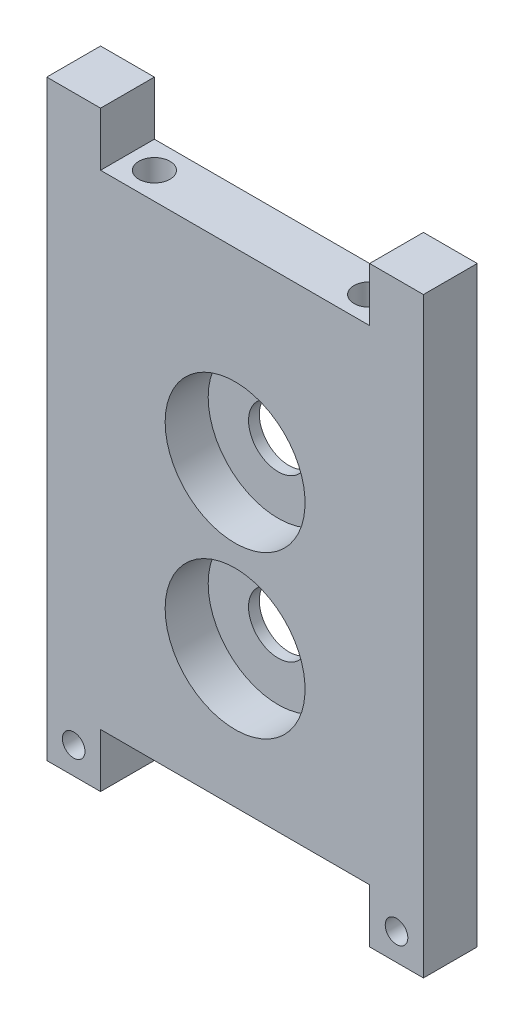
ISO-10303-21;
HEADER;
FILE_DESCRIPTION(('STEP AP214'),'2;1');
FILE_NAME('part.step','',(''),(''),'','','');
FILE_SCHEMA(('AUTOMOTIVE_DESIGN { 1 0 10303 214 1 1 1 1 }'));
ENDSEC;
DATA;
#1=APPLICATION_CONTEXT('core data for automotive mechanical design processes');
#2=APPLICATION_PROTOCOL_DEFINITION('international standard','automotive_design',2000,#1);
#3=PRODUCT_CONTEXT('',#1,'mechanical');
#4=PRODUCT('Part','Part','',(#3));
#5=PRODUCT_RELATED_PRODUCT_CATEGORY('part','',(#4));
#6=PRODUCT_DEFINITION_FORMATION('','',#4);
#7=PRODUCT_DEFINITION_CONTEXT('part definition',#1,'design');
#8=PRODUCT_DEFINITION('design','',#6,#7);
#9=PRODUCT_DEFINITION_SHAPE('','',#8);
#10=(LENGTH_UNIT() NAMED_UNIT(*) SI_UNIT(.MILLI.,.METRE.));
#11=(NAMED_UNIT(*) PLANE_ANGLE_UNIT() SI_UNIT($,.RADIAN.));
#12=(NAMED_UNIT(*) SI_UNIT($,.STERADIAN.) SOLID_ANGLE_UNIT());
#13=UNCERTAINTY_MEASURE_WITH_UNIT(LENGTH_MEASURE(1.E-05),#10,'distance_accuracy_value','');
#14=(GEOMETRIC_REPRESENTATION_CONTEXT(3) GLOBAL_UNCERTAINTY_ASSIGNED_CONTEXT((#13)) GLOBAL_UNIT_ASSIGNED_CONTEXT((#10,
#11,#12)) REPRESENTATION_CONTEXT('',''));
#15=CARTESIAN_POINT('',(0.,0.,0.));
#16=DIRECTION('',(0.,0.,1.));
#17=DIRECTION('',(1.,0.,0.));
#18=AXIS2_PLACEMENT_3D('',#15,#16,#17);
#19=CARTESIAN_POINT('',(20.,35.,5.));
#20=DIRECTION('',(0.,1.,0.));
#21=DIRECTION('',(-1.,0.,0.));
#22=AXIS2_PLACEMENT_3D('',#19,#20,#21);
#23=PLANE('',#22);
#24=CARTESIAN_POINT('',(20.,35.,5.));
#25=DIRECTION('',(0.,-1.,0.));
#26=DIRECTION('',(0.,0.,-1.));
#27=AXIS2_PLACEMENT_3D('',#24,#25,#26);
#28=CIRCLE('',#27,2.9);
#29=CARTESIAN_POINT('',(20.,35.,2.1));
#30=VERTEX_POINT('',#29);
#31=EDGE_CURVE('E20',#30,#30,#28,.F.);
#32=ORIENTED_EDGE('',*,*,#31,.T.);
#33=EDGE_LOOP('',(#32));
#34=FACE_BOUND('',#33,.T.);
#35=ADVANCED_FACE('F17',(#34),#23,.T.);
#36=CARTESIAN_POINT('',(-20.,35.,5.));
#37=DIRECTION('',(0.,1.,0.));
#38=DIRECTION('',(-1.,0.,0.));
#39=AXIS2_PLACEMENT_3D('',#36,#37,#38);
#40=PLANE('',#39);
#41=CARTESIAN_POINT('',(-20.,35.,5.));
#42=DIRECTION('',(0.,-1.,0.));
#43=DIRECTION('',(1.,0.,0.));
#44=AXIS2_PLACEMENT_3D('',#41,#42,#43);
#45=CIRCLE('',#44,2.9);
#46=CARTESIAN_POINT('',(-17.1,35.,5.));
#47=VERTEX_POINT('',#46);
#48=EDGE_CURVE('E175',#47,#47,#45,.F.);
#49=ORIENTED_EDGE('',*,*,#48,.T.);
#50=EDGE_LOOP('',(#49));
#51=FACE_BOUND('',#50,.T.);
#52=ADVANCED_FACE('F501',(#51),#40,.T.);
#53=CARTESIAN_POINT('',(0.,-19.52,10.));
#54=DIRECTION('',(0.,0.,-1.));
#55=DIRECTION('',(-1.,0.,0.));
#56=AXIS2_PLACEMENT_3D('',#53,#54,#55);
#57=CYLINDRICAL_SURFACE('',#56,13.);
#58=CARTESIAN_POINT('',(0.,-19.52,2.));
#59=DIRECTION('',(0.,0.,-1.));
#60=DIRECTION('',(-1.,0.,0.));
#61=AXIS2_PLACEMENT_3D('',#58,#59,#60);
#62=CIRCLE('',#61,13.);
#63=CARTESIAN_POINT('',(-13.,-19.52,2.));
#64=VERTEX_POINT('',#63);
#65=EDGE_CURVE('E167',#64,#64,#62,.F.);
#66=ORIENTED_EDGE('',*,*,#65,.F.);
#67=EDGE_LOOP('',(#66));
#68=FACE_BOUND('',#67,.T.);
#69=CARTESIAN_POINT('',(0.,-19.52,10.));
#70=DIRECTION('',(0.,0.,-1.));
#71=DIRECTION('',(-1.,0.,0.));
#72=AXIS2_PLACEMENT_3D('',#69,#70,#71);
#73=CIRCLE('',#72,13.);
#74=CARTESIAN_POINT('',(-13.,-19.52,10.));
#75=VERTEX_POINT('',#74);
#76=EDGE_CURVE('E170',#75,#75,#73,.T.);
#77=ORIENTED_EDGE('',*,*,#76,.F.);
#78=EDGE_LOOP('',(#77));
#79=FACE_BOUND('',#78,.T.);
#80=ADVANCED_FACE('F492',(#68,#79),#57,.F.);
#81=CARTESIAN_POINT('',(0.,10.48,10.));
#82=DIRECTION('',(0.,0.,-1.));
#83=DIRECTION('',(-1.,0.,0.));
#84=AXIS2_PLACEMENT_3D('',#81,#82,#83);
#85=CYLINDRICAL_SURFACE('',#84,13.);
#86=CARTESIAN_POINT('',(0.,10.48,2.));
#87=DIRECTION('',(0.,0.,-1.));
#88=DIRECTION('',(-1.,0.,0.));
#89=AXIS2_PLACEMENT_3D('',#86,#87,#88);
#90=CIRCLE('',#89,13.);
#91=CARTESIAN_POINT('',(-13.,10.48,2.));
#92=VERTEX_POINT('',#91);
#93=EDGE_CURVE('E127',#92,#92,#90,.F.);
#94=ORIENTED_EDGE('',*,*,#93,.F.);
#95=EDGE_LOOP('',(#94));
#96=FACE_BOUND('',#95,.T.);
#97=CARTESIAN_POINT('',(0.,10.48,10.));
#98=DIRECTION('',(0.,0.,-1.));
#99=DIRECTION('',(-1.,0.,0.));
#100=AXIS2_PLACEMENT_3D('',#97,#98,#99);
#101=CIRCLE('',#100,13.);
#102=CARTESIAN_POINT('',(-13.,10.48,10.));
#103=VERTEX_POINT('',#102);
#104=EDGE_CURVE('E173',#103,#103,#101,.T.);
#105=ORIENTED_EDGE('',*,*,#104,.F.);
#106=EDGE_LOOP('',(#105));
#107=FACE_BOUND('',#106,.T.);
#108=ADVANCED_FACE('F187',(#96,#107),#85,.F.);
#109=CARTESIAN_POINT('',(20.,45.,5.));
#110=DIRECTION('',(0.,-1.,0.));
#111=DIRECTION('',(0.,0.,-1.));
#112=AXIS2_PLACEMENT_3D('',#109,#110,#111);
#113=CYLINDRICAL_SURFACE('',#112,2.9);
#114=ORIENTED_EDGE('',*,*,#31,.F.);
#115=EDGE_LOOP('',(#114));
#116=FACE_BOUND('',#115,.T.);
#117=CARTESIAN_POINT('',(20.,45.,5.));
#118=DIRECTION('',(0.,-1.,0.));
#119=DIRECTION('',(0.,0.,-1.));
#120=AXIS2_PLACEMENT_3D('',#117,#118,#119);
#121=CIRCLE('',#120,2.9);
#122=CARTESIAN_POINT('',(20.,45.,2.1));
#123=VERTEX_POINT('',#122);
#124=EDGE_CURVE('E161',#123,#123,#121,.T.);
#125=ORIENTED_EDGE('',*,*,#124,.F.);
#126=EDGE_LOOP('',(#125));
#127=FACE_BOUND('',#126,.T.);
#128=ADVANCED_FACE('F183',(#116,#127),#113,.F.);
#129=CARTESIAN_POINT('',(-20.,45.,5.));
#130=DIRECTION('',(0.,-1.,0.));
#131=DIRECTION('',(1.,0.,0.));
#132=AXIS2_PLACEMENT_3D('',#129,#130,#131);
#133=CYLINDRICAL_SURFACE('',#132,2.9);
#134=ORIENTED_EDGE('',*,*,#48,.F.);
#135=EDGE_LOOP('',(#134));
#136=FACE_BOUND('',#135,.T.);
#137=CARTESIAN_POINT('',(-20.,45.,5.));
#138=DIRECTION('',(0.,-1.,0.));
#139=DIRECTION('',(1.,0.,0.));
#140=AXIS2_PLACEMENT_3D('',#137,#138,#139);
#141=CIRCLE('',#140,2.9);
#142=CARTESIAN_POINT('',(-17.1,45.,5.));
#143=VERTEX_POINT('',#142);
#144=EDGE_CURVE('E157',#143,#143,#141,.T.);
#145=ORIENTED_EDGE('',*,*,#144,.F.);
#146=EDGE_LOOP('',(#145));
#147=FACE_BOUND('',#146,.T.);
#148=ADVANCED_FACE('F186',(#136,#147),#133,.F.);
#149=CARTESIAN_POINT('',(0.,0.,10.));
#150=DIRECTION('',(0.,0.,1.));
#151=DIRECTION('',(1.,0.,0.));
#152=AXIS2_PLACEMENT_3D('',#149,#150,#151);
#153=PLANE('',#152);
#154=ORIENTED_EDGE('',*,*,#76,.T.);
#155=EDGE_LOOP('',(#154));
#156=FACE_BOUND('',#155,.T.);
#157=ORIENTED_EDGE('',*,*,#104,.T.);
#158=EDGE_LOOP('',(#157));
#159=FACE_BOUND('',#158,.T.);
#160=CARTESIAN_POINT('',(30.,-50.,10.));
#161=DIRECTION('',(0.,0.,-1.));
#162=DIRECTION('',(-1.,0.,0.));
#163=AXIS2_PLACEMENT_3D('',#160,#161,#162);
#164=CIRCLE('',#163,2.1);
#165=CARTESIAN_POINT('',(27.9,-50.,10.));
#166=VERTEX_POINT('',#165);
#167=EDGE_CURVE('E151',#166,#166,#164,.T.);
#168=ORIENTED_EDGE('',*,*,#167,.T.);
#169=EDGE_LOOP('',(#168));
#170=FACE_BOUND('',#169,.T.);
#171=CARTESIAN_POINT('',(-30.,-50.,10.));
#172=DIRECTION('',(0.,0.,-1.));
#173=DIRECTION('',(-1.,0.,0.));
#174=AXIS2_PLACEMENT_3D('',#171,#172,#173);
#175=CIRCLE('',#174,2.1);
#176=CARTESIAN_POINT('',(-32.1,-50.,10.));
#177=VERTEX_POINT('',#176);
#178=EDGE_CURVE('E154',#177,#177,#175,.T.);
#179=ORIENTED_EDGE('',*,*,#178,.T.);
#180=EDGE_LOOP('',(#179));
#181=FACE_BOUND('',#180,.T.);
#182=DIRECTION('',(0.,1.,0.));
#183=VECTOR('',#182,1.);
#184=CARTESIAN_POINT('',(-25.,45.,10.));
#185=LINE('',#184,#183);
#186=CARTESIAN_POINT('',(-25.,55.,10.));
#187=VERTEX_POINT('',#186);
#188=CARTESIAN_POINT('',(-25.,45.,10.));
#189=VERTEX_POINT('',#188);
#190=EDGE_CURVE('E160',#187,#189,#185,.F.);
#191=ORIENTED_EDGE('',*,*,#190,.F.);
#192=DIRECTION('',(1.,0.,0.));
#193=VECTOR('',#192,1.);
#194=CARTESIAN_POINT('',(-25.,55.,10.));
#195=LINE('',#194,#193);
#196=CARTESIAN_POINT('',(-35.,55.,10.));
#197=VERTEX_POINT('',#196);
#198=EDGE_CURVE('E260',#197,#187,#195,.T.);
#199=ORIENTED_EDGE('',*,*,#198,.F.);
#200=DIRECTION('',(0.,-1.,0.));
#201=VECTOR('',#200,1.);
#202=CARTESIAN_POINT('',(-35.,55.,10.));
#203=LINE('',#202,#201);
#204=CARTESIAN_POINT('',(-35.,-55.,10.));
#205=VERTEX_POINT('',#204);
#206=EDGE_CURVE('E123',#205,#197,#203,.F.);
#207=ORIENTED_EDGE('',*,*,#206,.F.);
#208=DIRECTION('',(1.,0.,0.));
#209=VECTOR('',#208,1.);
#210=CARTESIAN_POINT('',(-35.,-55.,10.));
#211=LINE('',#210,#209);
#212=CARTESIAN_POINT('',(-25.,-55.,10.));
#213=VERTEX_POINT('',#212);
#214=EDGE_CURVE('E117',#213,#205,#211,.F.);
#215=ORIENTED_EDGE('',*,*,#214,.F.);
#216=DIRECTION('',(0.,1.,0.));
#217=VECTOR('',#216,1.);
#218=CARTESIAN_POINT('',(-25.,-55.,10.));
#219=LINE('',#218,#217);
#220=CARTESIAN_POINT('',(-25.,-45.,10.));
#221=VERTEX_POINT('',#220);
#222=EDGE_CURVE('E108',#221,#213,#219,.F.);
#223=ORIENTED_EDGE('',*,*,#222,.F.);
#224=DIRECTION('',(1.,0.,0.));
#225=VECTOR('',#224,1.);
#226=CARTESIAN_POINT('',(-25.,-45.,10.));
#227=LINE('',#226,#225);
#228=CARTESIAN_POINT('',(25.,-45.,10.));
#229=VERTEX_POINT('',#228);
#230=EDGE_CURVE('E103',#229,#221,#227,.F.);
#231=ORIENTED_EDGE('',*,*,#230,.F.);
#232=DIRECTION('',(0.,-1.,0.));
#233=VECTOR('',#232,1.);
#234=CARTESIAN_POINT('',(25.,-45.,10.));
#235=LINE('',#234,#233);
#236=CARTESIAN_POINT('',(25.,-55.,10.));
#237=VERTEX_POINT('',#236);
#238=EDGE_CURVE('E236',#237,#229,#235,.F.);
#239=ORIENTED_EDGE('',*,*,#238,.F.);
#240=DIRECTION('',(1.,0.,0.));
#241=VECTOR('',#240,1.);
#242=CARTESIAN_POINT('',(25.,-55.,10.));
#243=LINE('',#242,#241);
#244=CARTESIAN_POINT('',(35.,-55.,10.));
#245=VERTEX_POINT('',#244);
#246=EDGE_CURVE('E232',#245,#237,#243,.F.);
#247=ORIENTED_EDGE('',*,*,#246,.F.);
#248=DIRECTION('',(0.,1.,0.));
#249=VECTOR('',#248,1.);
#250=CARTESIAN_POINT('',(35.,-55.,10.));
#251=LINE('',#250,#249);
#252=CARTESIAN_POINT('',(35.0000000000001,55.,10.));
#253=VERTEX_POINT('',#252);
#254=EDGE_CURVE('E228',#253,#245,#251,.F.);
#255=ORIENTED_EDGE('',*,*,#254,.F.);
#256=DIRECTION('',(1.,0.,0.));
#257=VECTOR('',#256,1.);
#258=CARTESIAN_POINT('',(35.,55.,10.));
#259=LINE('',#258,#257);
#260=CARTESIAN_POINT('',(25.,55.,10.));
#261=VERTEX_POINT('',#260);
#262=EDGE_CURVE('E211',#261,#253,#259,.T.);
#263=ORIENTED_EDGE('',*,*,#262,.F.);
#264=DIRECTION('',(0.,-1.,0.));
#265=VECTOR('',#264,1.);
#266=CARTESIAN_POINT('',(25.,55.,10.));
#267=LINE('',#266,#265);
#268=CARTESIAN_POINT('',(25.,45.,10.));
#269=VERTEX_POINT('',#268);
#270=EDGE_CURVE('E209',#269,#261,#267,.F.);
#271=ORIENTED_EDGE('',*,*,#270,.F.);
#272=DIRECTION('',(-1.,0.,0.));
#273=VECTOR('',#272,1.);
#274=CARTESIAN_POINT('',(25.,45.,10.));
#275=LINE('',#274,#273);
#276=EDGE_CURVE('E200',#189,#269,#275,.F.);
#277=ORIENTED_EDGE('',*,*,#276,.F.);
#278=EDGE_LOOP('',(#191,#199,#207,#215,#223,#231,#239,#247,#255,#263,#271,#277));
#279=FACE_BOUND('',#278,.T.);
#280=ADVANCED_FACE('F121',(#156,#159,#170,#181,#279),#153,.T.);
#281=CARTESIAN_POINT('',(0.,-19.52,2.));
#282=DIRECTION('',(0.,0.,1.));
#283=DIRECTION('',(1.,0.,0.));
#284=AXIS2_PLACEMENT_3D('',#281,#282,#283);
#285=PLANE('',#284);
#286=CARTESIAN_POINT('',(0.,-19.52,2.));
#287=DIRECTION('',(0.,0.,-1.));
#288=DIRECTION('',(-1.,0.,0.));
#289=AXIS2_PLACEMENT_3D('',#286,#287,#288);
#290=CIRCLE('',#289,5.5);
#291=CARTESIAN_POINT('',(-5.5,-19.52,2.));
#292=VERTEX_POINT('',#291);
#293=EDGE_CURVE('E148',#292,#292,#290,.T.);
#294=ORIENTED_EDGE('',*,*,#293,.T.);
#295=EDGE_LOOP('',(#294));
#296=FACE_BOUND('',#295,.T.);
#297=ORIENTED_EDGE('',*,*,#65,.T.);
#298=EDGE_LOOP('',(#297));
#299=FACE_BOUND('',#298,.T.);
#300=ADVANCED_FACE('F454',(#296,#299),#285,.T.);
#301=CARTESIAN_POINT('',(0.,10.48,2.));
#302=DIRECTION('',(0.,0.,1.));
#303=DIRECTION('',(1.,0.,0.));
#304=AXIS2_PLACEMENT_3D('',#301,#302,#303);
#305=PLANE('',#304);
#306=CARTESIAN_POINT('',(0.,10.48,2.));
#307=DIRECTION('',(0.,0.,-1.));
#308=DIRECTION('',(-1.,0.,0.));
#309=AXIS2_PLACEMENT_3D('',#306,#307,#308);
#310=CIRCLE('',#309,5.5);
#311=CARTESIAN_POINT('',(-5.5,10.48,2.));
#312=VERTEX_POINT('',#311);
#313=EDGE_CURVE('E145',#312,#312,#310,.T.);
#314=ORIENTED_EDGE('',*,*,#313,.T.);
#315=EDGE_LOOP('',(#314));
#316=FACE_BOUND('',#315,.T.);
#317=ORIENTED_EDGE('',*,*,#93,.T.);
#318=EDGE_LOOP('',(#317));
#319=FACE_BOUND('',#318,.T.);
#320=ADVANCED_FACE('F446',(#316,#319),#305,.T.);
#321=CARTESIAN_POINT('',(-35.,-55.,0.));
#322=DIRECTION('',(0.,-1.,0.));
#323=DIRECTION('',(1.,0.,0.));
#324=AXIS2_PLACEMENT_3D('',#321,#322,#323);
#325=PLANE('',#324);
#326=ORIENTED_EDGE('',*,*,#214,.T.);
#327=DIRECTION('',(0.,0.,1.));
#328=VECTOR('',#327,1.);
#329=CARTESIAN_POINT('',(-35.,-55.,0.));
#330=LINE('',#329,#328);
#331=CARTESIAN_POINT('',(-35.,-55.,0.));
#332=VERTEX_POINT('',#331);
#333=EDGE_CURVE('E256',#332,#205,#330,.T.);
#334=ORIENTED_EDGE('',*,*,#333,.F.);
#335=DIRECTION('',(1.,0.,0.));
#336=VECTOR('',#335,1.);
#337=CARTESIAN_POINT('',(0.,-55.,0.));
#338=LINE('',#337,#336);
#339=CARTESIAN_POINT('',(-25.,-55.,0.));
#340=VERTEX_POINT('',#339);
#341=EDGE_CURVE('E131',#332,#340,#338,.T.);
#342=ORIENTED_EDGE('',*,*,#341,.T.);
#343=DIRECTION('',(0.,0.,-1.));
#344=VECTOR('',#343,1.);
#345=CARTESIAN_POINT('',(-25.,-55.,0.));
#346=LINE('',#345,#344);
#347=EDGE_CURVE('E113',#213,#340,#346,.T.);
#348=ORIENTED_EDGE('',*,*,#347,.F.);
#349=EDGE_LOOP('',(#326,#334,#342,#348));
#350=FACE_BOUND('',#349,.T.);
#351=ADVANCED_FACE('F130',(#350),#325,.T.);
#352=CARTESIAN_POINT('',(-25.,-55.,0.));
#353=DIRECTION('',(1.,0.,0.));
#354=DIRECTION('',(0.,0.,-1.));
#355=AXIS2_PLACEMENT_3D('',#352,#353,#354);
#356=PLANE('',#355);
#357=ORIENTED_EDGE('',*,*,#222,.T.);
#358=ORIENTED_EDGE('',*,*,#347,.T.);
#359=DIRECTION('',(0.,1.,0.));
#360=VECTOR('',#359,1.);
#361=CARTESIAN_POINT('',(-25.,0.,0.));
#362=LINE('',#361,#360);
#363=CARTESIAN_POINT('',(-25.,-45.,0.));
#364=VERTEX_POINT('',#363);
#365=EDGE_CURVE('E245',#340,#364,#362,.T.);
#366=ORIENTED_EDGE('',*,*,#365,.T.);
#367=DIRECTION('',(0.,0.,1.));
#368=VECTOR('',#367,1.);
#369=CARTESIAN_POINT('',(-25.,-45.,0.));
#370=LINE('',#369,#368);
#371=EDGE_CURVE('E115',#221,#364,#370,.F.);
#372=ORIENTED_EDGE('',*,*,#371,.F.);
#373=EDGE_LOOP('',(#357,#358,#366,#372));
#374=FACE_BOUND('',#373,.T.);
#375=ADVANCED_FACE('F110',(#374),#356,.T.);
#376=CARTESIAN_POINT('',(-25.,-45.,0.));
#377=DIRECTION('',(0.,-1.,0.));
#378=DIRECTION('',(1.,0.,0.));
#379=AXIS2_PLACEMENT_3D('',#376,#377,#378);
#380=PLANE('',#379);
#381=ORIENTED_EDGE('',*,*,#230,.T.);
#382=ORIENTED_EDGE('',*,*,#371,.T.);
#383=DIRECTION('',(1.,0.,0.));
#384=VECTOR('',#383,1.);
#385=CARTESIAN_POINT('',(0.,-45.,0.));
#386=LINE('',#385,#384);
#387=CARTESIAN_POINT('',(25.,-45.,0.));
#388=VERTEX_POINT('',#387);
#389=EDGE_CURVE('E240',#364,#388,#386,.T.);
#390=ORIENTED_EDGE('',*,*,#389,.T.);
#391=DIRECTION('',(0.,0.,1.));
#392=VECTOR('',#391,1.);
#393=CARTESIAN_POINT('',(25.,-45.,0.));
#394=LINE('',#393,#392);
#395=EDGE_CURVE('E234',#229,#388,#394,.F.);
#396=ORIENTED_EDGE('',*,*,#395,.F.);
#397=EDGE_LOOP('',(#381,#382,#390,#396));
#398=FACE_BOUND('',#397,.T.);
#399=ADVANCED_FACE('F239',(#398),#380,.T.);
#400=CARTESIAN_POINT('',(25.,-45.,0.));
#401=DIRECTION('',(-1.,0.,0.));
#402=DIRECTION('',(0.,-1.,0.));
#403=AXIS2_PLACEMENT_3D('',#400,#401,#402);
#404=PLANE('',#403);
#405=ORIENTED_EDGE('',*,*,#238,.T.);
#406=ORIENTED_EDGE('',*,*,#395,.T.);
#407=DIRECTION('',(0.,1.,0.));
#408=VECTOR('',#407,1.);
#409=CARTESIAN_POINT('',(25.,0.,0.));
#410=LINE('',#409,#408);
#411=CARTESIAN_POINT('',(25.,-55.,0.));
#412=VERTEX_POINT('',#411);
#413=EDGE_CURVE('E248',#388,#412,#410,.F.);
#414=ORIENTED_EDGE('',*,*,#413,.T.);
#415=DIRECTION('',(0.,0.,-1.));
#416=VECTOR('',#415,1.);
#417=CARTESIAN_POINT('',(25.,-55.,0.));
#418=LINE('',#417,#416);
#419=EDGE_CURVE('E230',#237,#412,#418,.T.);
#420=ORIENTED_EDGE('',*,*,#419,.F.);
#421=EDGE_LOOP('',(#405,#406,#414,#420));
#422=FACE_BOUND('',#421,.T.);
#423=ADVANCED_FACE('F287',(#422),#404,.T.);
#424=CARTESIAN_POINT('',(25.,-55.,0.));
#425=DIRECTION('',(0.,-1.,0.));
#426=DIRECTION('',(0.,0.,-1.));
#427=AXIS2_PLACEMENT_3D('',#424,#425,#426);
#428=PLANE('',#427);
#429=ORIENTED_EDGE('',*,*,#246,.T.);
#430=ORIENTED_EDGE('',*,*,#419,.T.);
#431=DIRECTION('',(1.,0.,0.));
#432=VECTOR('',#431,1.);
#433=CARTESIAN_POINT('',(0.,-55.,0.));
#434=LINE('',#433,#432);
#435=CARTESIAN_POINT('',(35.,-55.,0.));
#436=VERTEX_POINT('',#435);
#437=EDGE_CURVE('E283',#412,#436,#434,.T.);
#438=ORIENTED_EDGE('',*,*,#437,.T.);
#439=DIRECTION('',(0.,0.,1.));
#440=VECTOR('',#439,1.);
#441=CARTESIAN_POINT('',(35.,-55.,0.));
#442=LINE('',#441,#440);
#443=EDGE_CURVE('E226',#245,#436,#442,.F.);
#444=ORIENTED_EDGE('',*,*,#443,.F.);
#445=EDGE_LOOP('',(#429,#430,#438,#444));
#446=FACE_BOUND('',#445,.T.);
#447=ADVANCED_FACE('F293',(#446),#428,.T.);
#448=CARTESIAN_POINT('',(35.,-55.,0.));
#449=DIRECTION('',(1.,0.,0.));
#450=DIRECTION('',(0.,1.,0.));
#451=AXIS2_PLACEMENT_3D('',#448,#449,#450);
#452=PLANE('',#451);
#453=ORIENTED_EDGE('',*,*,#254,.T.);
#454=ORIENTED_EDGE('',*,*,#443,.T.);
#455=DIRECTION('',(0.,1.,0.));
#456=VECTOR('',#455,1.);
#457=CARTESIAN_POINT('',(35.,0.,0.));
#458=LINE('',#457,#456);
#459=CARTESIAN_POINT('',(35.0000000000003,55.,0.));
#460=VERTEX_POINT('',#459);
#461=EDGE_CURVE('E280',#436,#460,#458,.T.);
#462=ORIENTED_EDGE('',*,*,#461,.T.);
#463=DIRECTION('',(0.,0.,1.));
#464=VECTOR('',#463,1.);
#465=CARTESIAN_POINT('',(35.,55.,0.));
#466=LINE('',#465,#464);
#467=EDGE_CURVE('E214',#253,#460,#466,.F.);
#468=ORIENTED_EDGE('',*,*,#467,.F.);
#469=EDGE_LOOP('',(#453,#454,#462,#468));
#470=FACE_BOUND('',#469,.T.);
#471=ADVANCED_FACE('F296',(#470),#452,.T.);
#472=CARTESIAN_POINT('',(35.,55.,0.));
#473=DIRECTION('',(0.,1.,0.));
#474=DIRECTION('',(0.,0.,1.));
#475=AXIS2_PLACEMENT_3D('',#472,#473,#474);
#476=PLANE('',#475);
#477=ORIENTED_EDGE('',*,*,#262,.T.);
#478=ORIENTED_EDGE('',*,*,#467,.T.);
#479=DIRECTION('',(1.,0.,0.));
#480=VECTOR('',#479,1.);
#481=CARTESIAN_POINT('',(0.,55.,0.));
#482=LINE('',#481,#480);
#483=CARTESIAN_POINT('',(25.,55.,0.));
#484=VERTEX_POINT('',#483);
#485=EDGE_CURVE('E277',#460,#484,#482,.F.);
#486=ORIENTED_EDGE('',*,*,#485,.T.);
#487=DIRECTION('',(0.,0.,1.));
#488=VECTOR('',#487,1.);
#489=CARTESIAN_POINT('',(25.,55.,0.));
#490=LINE('',#489,#488);
#491=EDGE_CURVE('E206',#261,#484,#490,.F.);
#492=ORIENTED_EDGE('',*,*,#491,.F.);
#493=EDGE_LOOP('',(#477,#478,#486,#492));
#494=FACE_BOUND('',#493,.T.);
#495=ADVANCED_FACE('F299',(#494),#476,.T.);
#496=CARTESIAN_POINT('',(25.,55.,0.));
#497=DIRECTION('',(-1.,0.,0.));
#498=DIRECTION('',(0.,-1.,0.));
#499=AXIS2_PLACEMENT_3D('',#496,#497,#498);
#500=PLANE('',#499);
#501=ORIENTED_EDGE('',*,*,#270,.T.);
#502=ORIENTED_EDGE('',*,*,#491,.T.);
#503=DIRECTION('',(0.,1.,0.));
#504=VECTOR('',#503,1.);
#505=CARTESIAN_POINT('',(25.,0.,0.));
#506=LINE('',#505,#504);
#507=CARTESIAN_POINT('',(25.,45.,0.));
#508=VERTEX_POINT('',#507);
#509=EDGE_CURVE('E218',#484,#508,#506,.F.);
#510=ORIENTED_EDGE('',*,*,#509,.T.);
#511=DIRECTION('',(0.,0.,1.));
#512=VECTOR('',#511,1.);
#513=CARTESIAN_POINT('',(25.,45.,0.));
#514=LINE('',#513,#512);
#515=EDGE_CURVE('E164',#269,#508,#514,.F.);
#516=ORIENTED_EDGE('',*,*,#515,.F.);
#517=EDGE_LOOP('',(#501,#502,#510,#516));
#518=FACE_BOUND('',#517,.T.);
#519=ADVANCED_FACE('F195',(#518),#500,.T.);
#520=CARTESIAN_POINT('',(25.,45.,0.));
#521=DIRECTION('',(0.,1.,0.));
#522=DIRECTION('',(-1.,0.,0.));
#523=AXIS2_PLACEMENT_3D('',#520,#521,#522);
#524=PLANE('',#523);
#525=ORIENTED_EDGE('',*,*,#144,.T.);
#526=EDGE_LOOP('',(#525));
#527=FACE_BOUND('',#526,.T.);
#528=ORIENTED_EDGE('',*,*,#124,.T.);
#529=EDGE_LOOP('',(#528));
#530=FACE_BOUND('',#529,.T.);
#531=ORIENTED_EDGE('',*,*,#276,.T.);
#532=ORIENTED_EDGE('',*,*,#515,.T.);
#533=DIRECTION('',(1.,0.,0.));
#534=VECTOR('',#533,1.);
#535=CARTESIAN_POINT('',(0.,45.,0.));
#536=LINE('',#535,#534);
#537=CARTESIAN_POINT('',(-25.,45.,0.));
#538=VERTEX_POINT('',#537);
#539=EDGE_CURVE('E272',#508,#538,#536,.F.);
#540=ORIENTED_EDGE('',*,*,#539,.T.);
#541=DIRECTION('',(0.,0.,1.));
#542=VECTOR('',#541,1.);
#543=CARTESIAN_POINT('',(-25.,45.,0.));
#544=LINE('',#543,#542);
#545=EDGE_CURVE('E205',#189,#538,#544,.F.);
#546=ORIENTED_EDGE('',*,*,#545,.F.);
#547=EDGE_LOOP('',(#531,#532,#540,#546));
#548=FACE_BOUND('',#547,.T.);
#549=ADVANCED_FACE('F191',(#527,#530,#548),#524,.T.);
#550=CARTESIAN_POINT('',(-25.,45.,0.));
#551=DIRECTION('',(1.,0.,0.));
#552=DIRECTION('',(0.,1.,0.));
#553=AXIS2_PLACEMENT_3D('',#550,#551,#552);
#554=PLANE('',#553);
#555=ORIENTED_EDGE('',*,*,#190,.T.);
#556=ORIENTED_EDGE('',*,*,#545,.T.);
#557=DIRECTION('',(0.,1.,0.));
#558=VECTOR('',#557,1.);
#559=CARTESIAN_POINT('',(-25.,0.,0.));
#560=LINE('',#559,#558);
#561=CARTESIAN_POINT('',(-25.,55.,0.));
#562=VERTEX_POINT('',#561);
#563=EDGE_CURVE('E269',#538,#562,#560,.T.);
#564=ORIENTED_EDGE('',*,*,#563,.T.);
#565=DIRECTION('',(0.,0.,1.));
#566=VECTOR('',#565,1.);
#567=CARTESIAN_POINT('',(-25.,55.,0.));
#568=LINE('',#567,#566);
#569=EDGE_CURVE('E258',#187,#562,#568,.F.);
#570=ORIENTED_EDGE('',*,*,#569,.F.);
#571=EDGE_LOOP('',(#555,#556,#564,#570));
#572=FACE_BOUND('',#571,.T.);
#573=ADVANCED_FACE('F194',(#572),#554,.T.);
#574=CARTESIAN_POINT('',(-25.,55.,0.));
#575=DIRECTION('',(0.,1.,0.));
#576=DIRECTION('',(0.,0.,1.));
#577=AXIS2_PLACEMENT_3D('',#574,#575,#576);
#578=PLANE('',#577);
#579=ORIENTED_EDGE('',*,*,#198,.T.);
#580=ORIENTED_EDGE('',*,*,#569,.T.);
#581=DIRECTION('',(1.,0.,0.));
#582=VECTOR('',#581,1.);
#583=CARTESIAN_POINT('',(0.,55.,0.));
#584=LINE('',#583,#582);
#585=CARTESIAN_POINT('',(-35.,55.,0.));
#586=VERTEX_POINT('',#585);
#587=EDGE_CURVE('E268',#562,#586,#584,.F.);
#588=ORIENTED_EDGE('',*,*,#587,.T.);
#589=DIRECTION('',(0.,0.,1.));
#590=VECTOR('',#589,1.);
#591=CARTESIAN_POINT('',(-35.,55.,0.));
#592=LINE('',#591,#590);
#593=EDGE_CURVE('E35',#197,#586,#592,.F.);
#594=ORIENTED_EDGE('',*,*,#593,.F.);
#595=EDGE_LOOP('',(#579,#580,#588,#594));
#596=FACE_BOUND('',#595,.T.);
#597=ADVANCED_FACE('F267',(#596),#578,.T.);
#598=CARTESIAN_POINT('',(-35.,55.,0.));
#599=DIRECTION('',(-1.,0.,0.));
#600=DIRECTION('',(0.,-1.,0.));
#601=AXIS2_PLACEMENT_3D('',#598,#599,#600);
#602=PLANE('',#601);
#603=ORIENTED_EDGE('',*,*,#206,.T.);
#604=ORIENTED_EDGE('',*,*,#593,.T.);
#605=DIRECTION('',(0.,1.,0.));
#606=VECTOR('',#605,1.);
#607=CARTESIAN_POINT('',(-35.,0.,0.));
#608=LINE('',#607,#606);
#609=EDGE_CURVE('E144',#586,#332,#608,.F.);
#610=ORIENTED_EDGE('',*,*,#609,.T.);
#611=ORIENTED_EDGE('',*,*,#333,.T.);
#612=EDGE_LOOP('',(#603,#604,#610,#611));
#613=FACE_BOUND('',#612,.T.);
#614=ADVANCED_FACE('F332',(#613),#602,.T.);
#615=CARTESIAN_POINT('',(-30.,-50.,10.));
#616=DIRECTION('',(0.,0.,-1.));
#617=DIRECTION('',(-1.,0.,0.));
#618=AXIS2_PLACEMENT_3D('',#615,#616,#617);
#619=CYLINDRICAL_SURFACE('',#618,2.1);
#620=CARTESIAN_POINT('',(-30.,-50.,0.));
#621=DIRECTION('',(0.,0.,-1.));
#622=DIRECTION('',(-1.,0.,0.));
#623=AXIS2_PLACEMENT_3D('',#620,#621,#622);
#624=CIRCLE('',#623,2.1);
#625=CARTESIAN_POINT('',(-32.1,-50.,0.));
#626=VERTEX_POINT('',#625);
#627=EDGE_CURVE('E141',#626,#626,#624,.T.);
#628=ORIENTED_EDGE('',*,*,#627,.T.);
#629=EDGE_LOOP('',(#628));
#630=FACE_BOUND('',#629,.T.);
#631=ORIENTED_EDGE('',*,*,#178,.F.);
#632=EDGE_LOOP('',(#631));
#633=FACE_BOUND('',#632,.T.);
#634=ADVANCED_FACE('F328',(#630,#633),#619,.F.);
#635=CARTESIAN_POINT('',(30.,-50.,10.));
#636=DIRECTION('',(0.,0.,-1.));
#637=DIRECTION('',(-1.,0.,0.));
#638=AXIS2_PLACEMENT_3D('',#635,#636,#637);
#639=CYLINDRICAL_SURFACE('',#638,2.1);
#640=CARTESIAN_POINT('',(30.,-50.,0.));
#641=DIRECTION('',(0.,0.,-1.));
#642=DIRECTION('',(-1.,0.,0.));
#643=AXIS2_PLACEMENT_3D('',#640,#641,#642);
#644=CIRCLE('',#643,2.1);
#645=CARTESIAN_POINT('',(27.9,-50.,0.));
#646=VERTEX_POINT('',#645);
#647=EDGE_CURVE('E138',#646,#646,#644,.T.);
#648=ORIENTED_EDGE('',*,*,#647,.T.);
#649=EDGE_LOOP('',(#648));
#650=FACE_BOUND('',#649,.T.);
#651=ORIENTED_EDGE('',*,*,#167,.F.);
#652=EDGE_LOOP('',(#651));
#653=FACE_BOUND('',#652,.T.);
#654=ADVANCED_FACE('F324',(#650,#653),#639,.F.);
#655=CARTESIAN_POINT('',(0.,-19.52,2.));
#656=DIRECTION('',(0.,0.,-1.));
#657=DIRECTION('',(-1.,0.,0.));
#658=AXIS2_PLACEMENT_3D('',#655,#656,#657);
#659=CYLINDRICAL_SURFACE('',#658,5.5);
#660=CARTESIAN_POINT('',(0.,-19.52,0.));
#661=DIRECTION('',(0.,0.,-1.));
#662=DIRECTION('',(-1.,0.,0.));
#663=AXIS2_PLACEMENT_3D('',#660,#661,#662);
#664=CIRCLE('',#663,5.5);
#665=CARTESIAN_POINT('',(-5.5,-19.52,0.));
#666=VERTEX_POINT('',#665);
#667=EDGE_CURVE('E26',#666,#666,#664,.T.);
#668=ORIENTED_EDGE('',*,*,#667,.T.);
#669=EDGE_LOOP('',(#668));
#670=FACE_BOUND('',#669,.T.);
#671=ORIENTED_EDGE('',*,*,#293,.F.);
#672=EDGE_LOOP('',(#671));
#673=FACE_BOUND('',#672,.T.);
#674=ADVANCED_FACE('F316',(#670,#673),#659,.F.);
#675=CARTESIAN_POINT('',(0.,10.48,2.));
#676=DIRECTION('',(0.,0.,-1.));
#677=DIRECTION('',(-1.,0.,0.));
#678=AXIS2_PLACEMENT_3D('',#675,#676,#677);
#679=CYLINDRICAL_SURFACE('',#678,5.5);
#680=CARTESIAN_POINT('',(0.,10.48,0.));
#681=DIRECTION('',(0.,0.,-1.));
#682=DIRECTION('',(-1.,0.,0.));
#683=AXIS2_PLACEMENT_3D('',#680,#681,#682);
#684=CIRCLE('',#683,5.5);
#685=CARTESIAN_POINT('',(-5.5,10.48,0.));
#686=VERTEX_POINT('',#685);
#687=EDGE_CURVE('E11',#686,#686,#684,.T.);
#688=ORIENTED_EDGE('',*,*,#687,.T.);
#689=EDGE_LOOP('',(#688));
#690=FACE_BOUND('',#689,.T.);
#691=ORIENTED_EDGE('',*,*,#313,.F.);
#692=EDGE_LOOP('',(#691));
#693=FACE_BOUND('',#692,.T.);
#694=ADVANCED_FACE('F310',(#690,#693),#679,.F.);
#695=CARTESIAN_POINT('',(0.,0.,0.));
#696=DIRECTION('',(0.,0.,1.));
#697=DIRECTION('',(1.,0.,0.));
#698=AXIS2_PLACEMENT_3D('',#695,#696,#697);
#699=PLANE('',#698);
#700=ORIENTED_EDGE('',*,*,#687,.F.);
#701=EDGE_LOOP('',(#700));
#702=FACE_BOUND('',#701,.T.);
#703=ORIENTED_EDGE('',*,*,#667,.F.);
#704=EDGE_LOOP('',(#703));
#705=FACE_BOUND('',#704,.T.);
#706=ORIENTED_EDGE('',*,*,#647,.F.);
#707=EDGE_LOOP('',(#706));
#708=FACE_BOUND('',#707,.T.);
#709=ORIENTED_EDGE('',*,*,#627,.F.);
#710=EDGE_LOOP('',(#709));
#711=FACE_BOUND('',#710,.T.);
#712=ORIENTED_EDGE('',*,*,#587,.F.);
#713=ORIENTED_EDGE('',*,*,#563,.F.);
#714=ORIENTED_EDGE('',*,*,#539,.F.);
#715=ORIENTED_EDGE('',*,*,#509,.F.);
#716=ORIENTED_EDGE('',*,*,#485,.F.);
#717=ORIENTED_EDGE('',*,*,#461,.F.);
#718=ORIENTED_EDGE('',*,*,#437,.F.);
#719=ORIENTED_EDGE('',*,*,#413,.F.);
#720=ORIENTED_EDGE('',*,*,#389,.F.);
#721=ORIENTED_EDGE('',*,*,#365,.F.);
#722=ORIENTED_EDGE('',*,*,#341,.F.);
#723=ORIENTED_EDGE('',*,*,#609,.F.);
#724=EDGE_LOOP('',(#712,#713,#714,#715,#716,#717,#718,#719,#720,#721,#722,#723));
#725=FACE_BOUND('',#724,.T.);
#726=ADVANCED_FACE('F244',(#702,#705,#708,#711,#725),#699,.F.);
#727=CLOSED_SHELL('',(#35,#52,#80,#108,#128,#148,#280,#300,#320,#351,#375,#399,#423,#447,#471,
#495,#519,#549,#573,#597,#614,#634,#654,#674,#694,#726));
#728=MANIFOLD_SOLID_BREP('B1',#727);
#729=ADVANCED_BREP_SHAPE_REPRESENTATION('',(#18,#728),#14);
#730=SHAPE_DEFINITION_REPRESENTATION(#9,#729);
ENDSEC;
END-ISO-10303-21;
